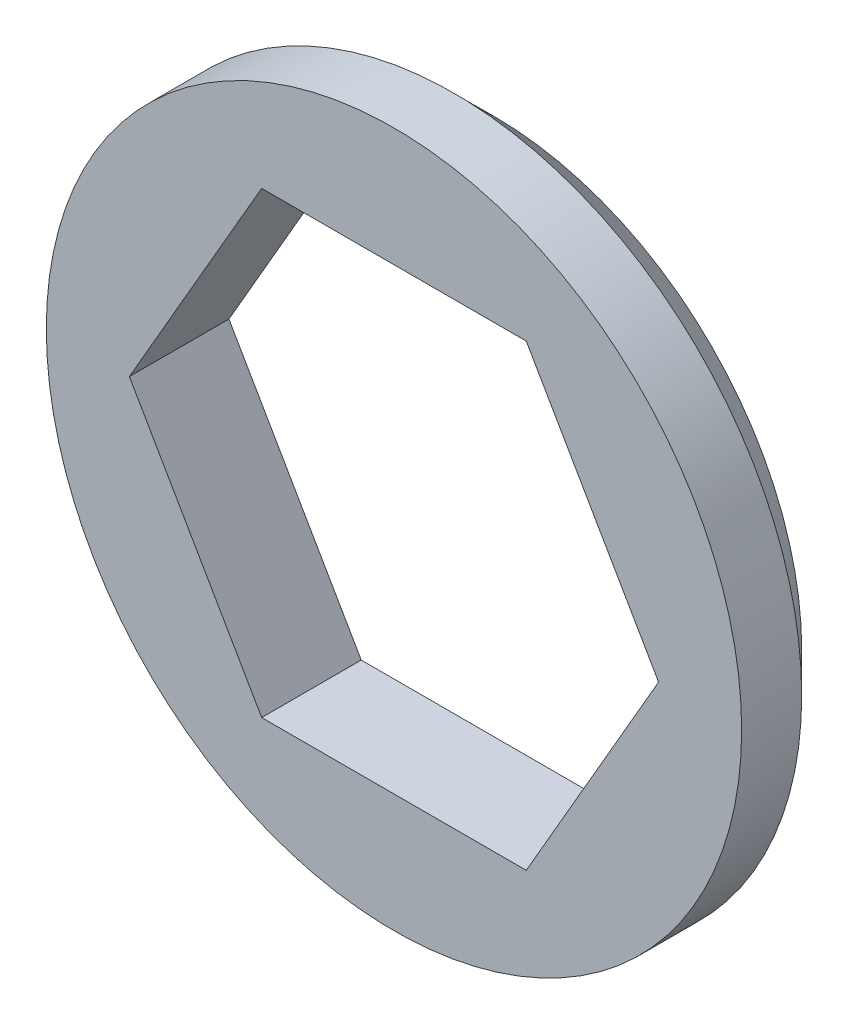
ISO-10303-21;
HEADER;
FILE_DESCRIPTION(('STEP AP214'),'2;1');
FILE_NAME('part.step','',(''),(''),'','','');
FILE_SCHEMA(('AUTOMOTIVE_DESIGN { 1 0 10303 214 1 1 1 1 }'));
ENDSEC;
DATA;
#1=APPLICATION_CONTEXT('core data for automotive mechanical design processes');
#2=APPLICATION_PROTOCOL_DEFINITION('international standard','automotive_design',2000,#1);
#3=PRODUCT_CONTEXT('',#1,'mechanical');
#4=PRODUCT('Part','Part','',(#3));
#5=PRODUCT_RELATED_PRODUCT_CATEGORY('part','',(#4));
#6=PRODUCT_DEFINITION_FORMATION('','',#4);
#7=PRODUCT_DEFINITION_CONTEXT('part definition',#1,'design');
#8=PRODUCT_DEFINITION('design','',#6,#7);
#9=PRODUCT_DEFINITION_SHAPE('','',#8);
#10=(LENGTH_UNIT() NAMED_UNIT(*) SI_UNIT(.MILLI.,.METRE.));
#11=(NAMED_UNIT(*) PLANE_ANGLE_UNIT() SI_UNIT($,.RADIAN.));
#12=(NAMED_UNIT(*) SI_UNIT($,.STERADIAN.) SOLID_ANGLE_UNIT());
#13=UNCERTAINTY_MEASURE_WITH_UNIT(LENGTH_MEASURE(1.E-05),#10,'distance_accuracy_value','');
#14=(GEOMETRIC_REPRESENTATION_CONTEXT(3) GLOBAL_UNCERTAINTY_ASSIGNED_CONTEXT((#13)) GLOBAL_UNIT_ASSIGNED_CONTEXT((#10,
#11,#12)) REPRESENTATION_CONTEXT('',''));
#15=CARTESIAN_POINT('',(0.,0.,0.));
#16=DIRECTION('',(0.,0.,1.));
#17=DIRECTION('',(1.,0.,0.));
#18=AXIS2_PLACEMENT_3D('',#15,#16,#17);
#19=CARTESIAN_POINT('',(0.,0.,3.15));
#20=DIRECTION('',(0.,0.,1.));
#21=DIRECTION('',(1.,0.,0.));
#22=AXIS2_PLACEMENT_3D('',#19,#20,#21);
#23=PLANE('',#22);
#24=CARTESIAN_POINT('',(0.,0.,3.15));
#25=DIRECTION('',(0.,0.,1.));
#26=DIRECTION('',(1.,0.,0.));
#27=AXIS2_PLACEMENT_3D('',#24,#25,#26);
#28=CIRCLE('',#27,11.);
#29=CARTESIAN_POINT('',(11.,0.,3.15));
#30=VERTEX_POINT('',#29);
#31=EDGE_CURVE('E106',#30,#30,#28,.T.);
#32=ORIENTED_EDGE('',*,*,#31,.T.);
#33=EDGE_LOOP('',(#32));
#34=FACE_BOUND('',#33,.T.);
#35=DIRECTION('',(-0.5,0.866025403784439,0.));
#36=VECTOR('',#35,1.);
#37=CARTESIAN_POINT('',(8.37157890324957,0.,3.15));
#38=LINE('',#37,#36);
#39=CARTESIAN_POINT('',(8.37157890324957,0.,3.15));
#40=VERTEX_POINT('',#39);
#41=CARTESIAN_POINT('',(4.18578945162478,7.25,3.15));
#42=VERTEX_POINT('',#41);
#43=EDGE_CURVE('E98',#40,#42,#38,.T.);
#44=ORIENTED_EDGE('',*,*,#43,.F.);
#45=DIRECTION('',(0.5,0.866025403784439,0.));
#46=VECTOR('',#45,1.);
#47=CARTESIAN_POINT('',(4.18578945162479,-7.25,3.15));
#48=LINE('',#47,#46);
#49=CARTESIAN_POINT('',(4.18578945162479,-7.25,3.15));
#50=VERTEX_POINT('',#49);
#51=EDGE_CURVE('E90',#50,#40,#48,.T.);
#52=ORIENTED_EDGE('',*,*,#51,.F.);
#53=DIRECTION('',(1.,0.,0.));
#54=VECTOR('',#53,1.);
#55=CARTESIAN_POINT('',(-4.18578945162479,-7.25,3.15));
#56=LINE('',#55,#54);
#57=CARTESIAN_POINT('',(-4.18578945162479,-7.25,3.15));
#58=VERTEX_POINT('',#57);
#59=EDGE_CURVE('E119',#58,#50,#56,.T.);
#60=ORIENTED_EDGE('',*,*,#59,.F.);
#61=DIRECTION('',(0.5,-0.866025403784439,0.));
#62=VECTOR('',#61,1.);
#63=CARTESIAN_POINT('',(-8.37157890324958,0.,3.15));
#64=LINE('',#63,#62);
#65=CARTESIAN_POINT('',(-8.37157890324958,0.,3.15));
#66=VERTEX_POINT('',#65);
#67=EDGE_CURVE('E117',#66,#58,#64,.T.);
#68=ORIENTED_EDGE('',*,*,#67,.F.);
#69=DIRECTION('',(-0.5,-0.866025403784439,0.));
#70=VECTOR('',#69,1.);
#71=CARTESIAN_POINT('',(-4.18578945162479,7.25,3.15));
#72=LINE('',#71,#70);
#73=CARTESIAN_POINT('',(-4.18578945162479,7.25,3.15));
#74=VERTEX_POINT('',#73);
#75=EDGE_CURVE('E113',#74,#66,#72,.T.);
#76=ORIENTED_EDGE('',*,*,#75,.F.);
#77=DIRECTION('',(-1.,0.,0.));
#78=VECTOR('',#77,1.);
#79=CARTESIAN_POINT('',(4.18578945162478,7.25,3.15));
#80=LINE('',#79,#78);
#81=EDGE_CURVE('E111',#42,#74,#80,.T.);
#82=ORIENTED_EDGE('',*,*,#81,.F.);
#83=EDGE_LOOP('',(#44,#52,#60,#68,#76,#82));
#84=FACE_BOUND('',#83,.T.);
#85=ADVANCED_FACE('F36',(#34,#84),#23,.T.);
#86=CARTESIAN_POINT('',(0.,0.,0.));
#87=DIRECTION('',(0.,0.,1.));
#88=DIRECTION('',(1.,0.,0.));
#89=AXIS2_PLACEMENT_3D('',#86,#87,#88);
#90=PLANE('',#89);
#91=CARTESIAN_POINT('',(0.,0.,0.));
#92=DIRECTION('',(0.,0.,1.));
#93=DIRECTION('',(1.,0.,0.));
#94=AXIS2_PLACEMENT_3D('',#91,#92,#93);
#95=CIRCLE('',#94,9.74999999999999);
#96=CARTESIAN_POINT('',(9.74999999999999,0.,0.));
#97=VERTEX_POINT('',#96);
#98=EDGE_CURVE('E11',#97,#97,#95,.F.);
#99=ORIENTED_EDGE('',*,*,#98,.T.);
#100=EDGE_LOOP('',(#99));
#101=FACE_BOUND('',#100,.T.);
#102=DIRECTION('',(0.5,0.866025403784439,0.));
#103=VECTOR('',#102,1.);
#104=CARTESIAN_POINT('',(4.18578945162479,-7.25,0.));
#105=LINE('',#104,#103);
#106=CARTESIAN_POINT('',(4.18578945162479,-7.25,0.));
#107=VERTEX_POINT('',#106);
#108=CARTESIAN_POINT('',(8.37157890324957,0.,0.));
#109=VERTEX_POINT('',#108);
#110=EDGE_CURVE('E60',#107,#109,#105,.T.);
#111=ORIENTED_EDGE('',*,*,#110,.T.);
#112=DIRECTION('',(-0.5,0.866025403784439,0.));
#113=VECTOR('',#112,1.);
#114=CARTESIAN_POINT('',(8.37157890324957,0.,0.));
#115=LINE('',#114,#113);
#116=CARTESIAN_POINT('',(4.18578945162478,7.25,0.));
#117=VERTEX_POINT('',#116);
#118=EDGE_CURVE('E105',#109,#117,#115,.T.);
#119=ORIENTED_EDGE('',*,*,#118,.T.);
#120=DIRECTION('',(-1.,0.,0.));
#121=VECTOR('',#120,1.);
#122=CARTESIAN_POINT('',(4.18578945162478,7.25,0.));
#123=LINE('',#122,#121);
#124=CARTESIAN_POINT('',(-4.18578945162479,7.25,0.));
#125=VERTEX_POINT('',#124);
#126=EDGE_CURVE('E123',#117,#125,#123,.T.);
#127=ORIENTED_EDGE('',*,*,#126,.T.);
#128=DIRECTION('',(-0.5,-0.866025403784439,0.));
#129=VECTOR('',#128,1.);
#130=CARTESIAN_POINT('',(-4.18578945162479,7.25,0.));
#131=LINE('',#130,#129);
#132=CARTESIAN_POINT('',(-8.37157890324958,0.,0.));
#133=VERTEX_POINT('',#132);
#134=EDGE_CURVE('E126',#125,#133,#131,.T.);
#135=ORIENTED_EDGE('',*,*,#134,.T.);
#136=DIRECTION('',(0.5,-0.866025403784439,0.));
#137=VECTOR('',#136,1.);
#138=CARTESIAN_POINT('',(-8.37157890324958,0.,0.));
#139=LINE('',#138,#137);
#140=CARTESIAN_POINT('',(-4.18578945162479,-7.25,0.));
#141=VERTEX_POINT('',#140);
#142=EDGE_CURVE('E129',#133,#141,#139,.T.);
#143=ORIENTED_EDGE('',*,*,#142,.T.);
#144=DIRECTION('',(1.,0.,0.));
#145=VECTOR('',#144,1.);
#146=CARTESIAN_POINT('',(-4.18578945162479,-7.25,0.));
#147=LINE('',#146,#145);
#148=EDGE_CURVE('E99',#141,#107,#147,.T.);
#149=ORIENTED_EDGE('',*,*,#148,.T.);
#150=EDGE_LOOP('',(#111,#119,#127,#135,#143,#149));
#151=FACE_BOUND('',#150,.T.);
#152=ADVANCED_FACE('F158',(#101,#151),#90,.F.);
#153=CARTESIAN_POINT('',(0.,0.,3.15));
#154=DIRECTION('',(0.,0.,-1.));
#155=DIRECTION('',(-1.,0.,0.));
#156=AXIS2_PLACEMENT_3D('',#153,#154,#155);
#157=CYLINDRICAL_SURFACE('',#156,11.);
#158=CARTESIAN_POINT('',(0.,0.,1.25));
#159=DIRECTION('',(0.,0.,1.));
#160=DIRECTION('',(1.,0.,0.));
#161=AXIS2_PLACEMENT_3D('',#158,#159,#160);
#162=CIRCLE('',#161,11.);
#163=CARTESIAN_POINT('',(11.,0.,1.25));
#164=VERTEX_POINT('',#163);
#165=EDGE_CURVE('E45',#164,#164,#162,.T.);
#166=ORIENTED_EDGE('',*,*,#165,.T.);
#167=EDGE_LOOP('',(#166));
#168=FACE_BOUND('',#167,.T.);
#169=ORIENTED_EDGE('',*,*,#31,.F.);
#170=EDGE_LOOP('',(#169));
#171=FACE_BOUND('',#170,.T.);
#172=ADVANCED_FACE('F145',(#168,#171),#157,.T.);
#173=CARTESIAN_POINT('',(4.18578945162479,-7.25,3.15));
#174=DIRECTION('',(-0.866025403784439,0.5,0.));
#175=DIRECTION('',(-0.5,-0.866025403784439,0.));
#176=AXIS2_PLACEMENT_3D('',#173,#174,#175);
#177=PLANE('',#176);
#178=ORIENTED_EDGE('',*,*,#110,.F.);
#179=DIRECTION('',(0.,0.,-1.));
#180=VECTOR('',#179,1.);
#181=CARTESIAN_POINT('',(4.18578945162479,-7.25,3.15));
#182=LINE('',#181,#180);
#183=EDGE_CURVE('E94',#50,#107,#182,.T.);
#184=ORIENTED_EDGE('',*,*,#183,.F.);
#185=ORIENTED_EDGE('',*,*,#51,.T.);
#186=DIRECTION('',(0.,0.,-1.));
#187=VECTOR('',#186,1.);
#188=CARTESIAN_POINT('',(8.37157890324957,0.,3.15));
#189=LINE('',#188,#187);
#190=EDGE_CURVE('E93',#40,#109,#189,.T.);
#191=ORIENTED_EDGE('',*,*,#190,.T.);
#192=EDGE_LOOP('',(#178,#184,#185,#191));
#193=FACE_BOUND('',#192,.T.);
#194=ADVANCED_FACE('F92',(#193),#177,.T.);
#195=CARTESIAN_POINT('',(8.37157890324957,0.,3.15));
#196=DIRECTION('',(-0.866025403784439,-0.5,0.));
#197=DIRECTION('',(0.5,-0.866025403784439,0.));
#198=AXIS2_PLACEMENT_3D('',#195,#196,#197);
#199=PLANE('',#198);
#200=ORIENTED_EDGE('',*,*,#118,.F.);
#201=ORIENTED_EDGE('',*,*,#190,.F.);
#202=ORIENTED_EDGE('',*,*,#43,.T.);
#203=DIRECTION('',(0.,0.,-1.));
#204=VECTOR('',#203,1.);
#205=CARTESIAN_POINT('',(4.18578945162478,7.25,3.15));
#206=LINE('',#205,#204);
#207=EDGE_CURVE('E107',#42,#117,#206,.T.);
#208=ORIENTED_EDGE('',*,*,#207,.T.);
#209=EDGE_LOOP('',(#200,#201,#202,#208));
#210=FACE_BOUND('',#209,.T.);
#211=ADVANCED_FACE('F102',(#210),#199,.T.);
#212=CARTESIAN_POINT('',(4.18578945162478,7.25,3.15));
#213=DIRECTION('',(0.,-1.,0.));
#214=DIRECTION('',(1.,0.,0.));
#215=AXIS2_PLACEMENT_3D('',#212,#213,#214);
#216=PLANE('',#215);
#217=ORIENTED_EDGE('',*,*,#126,.F.);
#218=ORIENTED_EDGE('',*,*,#207,.F.);
#219=ORIENTED_EDGE('',*,*,#81,.T.);
#220=DIRECTION('',(0.,0.,-1.));
#221=VECTOR('',#220,1.);
#222=CARTESIAN_POINT('',(-4.18578945162479,7.25,3.15));
#223=LINE('',#222,#221);
#224=EDGE_CURVE('E138',#74,#125,#223,.T.);
#225=ORIENTED_EDGE('',*,*,#224,.T.);
#226=EDGE_LOOP('',(#217,#218,#219,#225));
#227=FACE_BOUND('',#226,.T.);
#228=ADVANCED_FACE('F175',(#227),#216,.T.);
#229=CARTESIAN_POINT('',(-4.18578945162479,7.25,3.15));
#230=DIRECTION('',(0.866025403784439,-0.5,0.));
#231=DIRECTION('',(0.5,0.866025403784439,0.));
#232=AXIS2_PLACEMENT_3D('',#229,#230,#231);
#233=PLANE('',#232);
#234=ORIENTED_EDGE('',*,*,#134,.F.);
#235=ORIENTED_EDGE('',*,*,#224,.F.);
#236=ORIENTED_EDGE('',*,*,#75,.T.);
#237=DIRECTION('',(0.,0.,-1.));
#238=VECTOR('',#237,1.);
#239=CARTESIAN_POINT('',(-8.37157890324958,0.,3.15));
#240=LINE('',#239,#238);
#241=EDGE_CURVE('E136',#66,#133,#240,.T.);
#242=ORIENTED_EDGE('',*,*,#241,.T.);
#243=EDGE_LOOP('',(#234,#235,#236,#242));
#244=FACE_BOUND('',#243,.T.);
#245=ADVANCED_FACE('F179',(#244),#233,.T.);
#246=CARTESIAN_POINT('',(-8.37157890324958,0.,3.15));
#247=DIRECTION('',(0.866025403784439,0.5,0.));
#248=DIRECTION('',(-0.5,0.866025403784439,0.));
#249=AXIS2_PLACEMENT_3D('',#246,#247,#248);
#250=PLANE('',#249);
#251=ORIENTED_EDGE('',*,*,#142,.F.);
#252=ORIENTED_EDGE('',*,*,#241,.F.);
#253=ORIENTED_EDGE('',*,*,#67,.T.);
#254=DIRECTION('',(0.,0.,-1.));
#255=VECTOR('',#254,1.);
#256=CARTESIAN_POINT('',(-4.18578945162479,-7.25,3.15));
#257=LINE('',#256,#255);
#258=EDGE_CURVE('E52',#58,#141,#257,.T.);
#259=ORIENTED_EDGE('',*,*,#258,.T.);
#260=EDGE_LOOP('',(#251,#252,#253,#259));
#261=FACE_BOUND('',#260,.T.);
#262=ADVANCED_FACE('F154',(#261),#250,.T.);
#263=CARTESIAN_POINT('',(-4.18578945162479,-7.25,3.15));
#264=DIRECTION('',(0.,1.,0.));
#265=DIRECTION('',(-1.,0.,0.));
#266=AXIS2_PLACEMENT_3D('',#263,#264,#265);
#267=PLANE('',#266);
#268=ORIENTED_EDGE('',*,*,#148,.F.);
#269=ORIENTED_EDGE('',*,*,#258,.F.);
#270=ORIENTED_EDGE('',*,*,#59,.T.);
#271=ORIENTED_EDGE('',*,*,#183,.T.);
#272=EDGE_LOOP('',(#268,#269,#270,#271));
#273=FACE_BOUND('',#272,.T.);
#274=ADVANCED_FACE('F149',(#273),#267,.T.);
#275=CARTESIAN_POINT('',(0.,0.,1.25));
#276=DIRECTION('',(0.,0.,1.));
#277=DIRECTION('',(1.,0.,0.));
#278=AXIS2_PLACEMENT_3D('',#275,#276,#277);
#279=CONICAL_SURFACE('',#278,11.,0.78539816339745);
#280=ORIENTED_EDGE('',*,*,#98,.F.);
#281=EDGE_LOOP('',(#280));
#282=FACE_BOUND('',#281,.T.);
#283=ORIENTED_EDGE('',*,*,#165,.F.);
#284=EDGE_LOOP('',(#283));
#285=FACE_BOUND('',#284,.T.);
#286=ADVANCED_FACE('F39',(#282,#285),#279,.T.);
#287=CLOSED_SHELL('',(#85,#152,#172,#194,#211,#228,#245,#262,#274,#286));
#288=MANIFOLD_SOLID_BREP('B2',#287);
#289=ADVANCED_BREP_SHAPE_REPRESENTATION('',(#18,#288),#14);
#290=SHAPE_DEFINITION_REPRESENTATION(#9,#289);
ENDSEC;
END-ISO-10303-21;
